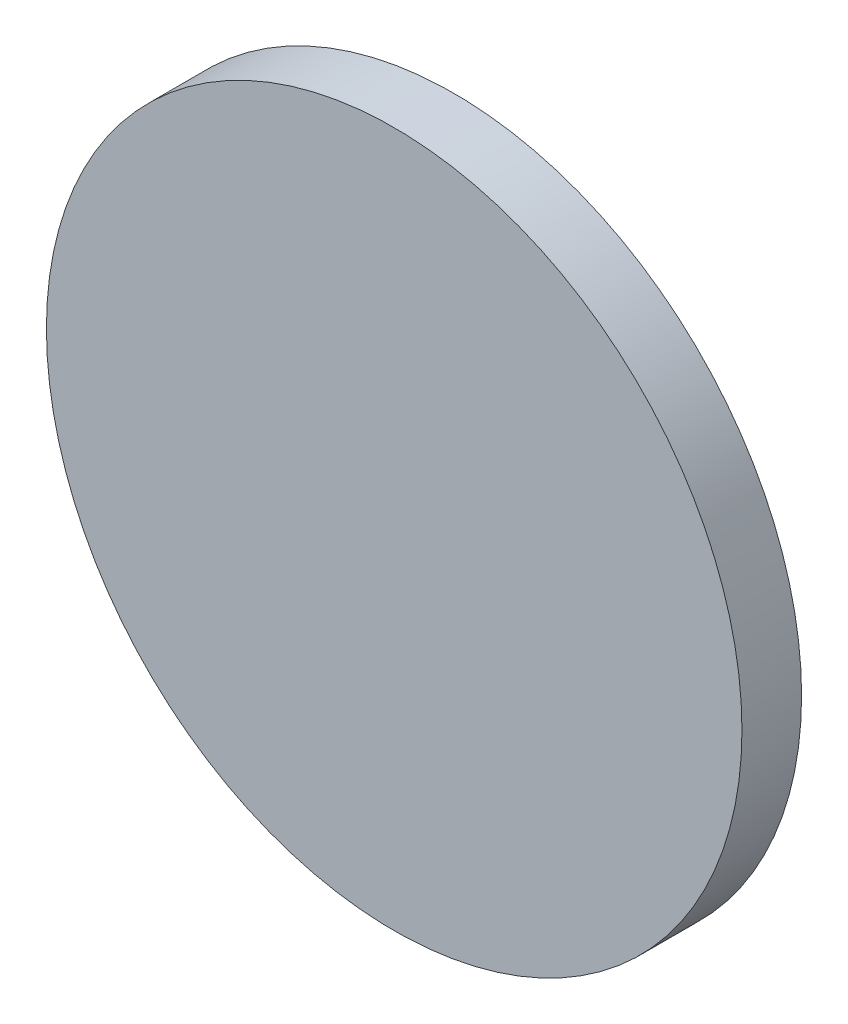
ISO-10303-21;
HEADER;
FILE_DESCRIPTION(('STEP AP214'),'2;1');
FILE_NAME('part.step','',(''),(''),'','','');
FILE_SCHEMA(('AUTOMOTIVE_DESIGN { 1 0 10303 214 1 1 1 1 }'));
ENDSEC;
DATA;
#1=APPLICATION_CONTEXT('core data for automotive mechanical design processes');
#2=APPLICATION_PROTOCOL_DEFINITION('international standard','automotive_design',2000,#1);
#3=PRODUCT_CONTEXT('',#1,'mechanical');
#4=PRODUCT('Part','Part','',(#3));
#5=PRODUCT_RELATED_PRODUCT_CATEGORY('part','',(#4));
#6=PRODUCT_DEFINITION_FORMATION('','',#4);
#7=PRODUCT_DEFINITION_CONTEXT('part definition',#1,'design');
#8=PRODUCT_DEFINITION('design','',#6,#7);
#9=PRODUCT_DEFINITION_SHAPE('','',#8);
#10=(LENGTH_UNIT() NAMED_UNIT(*) SI_UNIT(.MILLI.,.METRE.));
#11=(NAMED_UNIT(*) PLANE_ANGLE_UNIT() SI_UNIT($,.RADIAN.));
#12=(NAMED_UNIT(*) SI_UNIT($,.STERADIAN.) SOLID_ANGLE_UNIT());
#13=UNCERTAINTY_MEASURE_WITH_UNIT(LENGTH_MEASURE(1.E-05),#10,'distance_accuracy_value','');
#14=(GEOMETRIC_REPRESENTATION_CONTEXT(3) GLOBAL_UNCERTAINTY_ASSIGNED_CONTEXT((#13)) GLOBAL_UNIT_ASSIGNED_CONTEXT((#10,
#11,#12)) REPRESENTATION_CONTEXT('',''));
#15=CARTESIAN_POINT('',(0.,0.,0.));
#16=DIRECTION('',(0.,0.,1.));
#17=DIRECTION('',(1.,0.,0.));
#18=AXIS2_PLACEMENT_3D('',#15,#16,#17);
#19=CARTESIAN_POINT('',(4.6101,9.7663,0.76487));
#20=DIRECTION('',(0.,0.,-1.));
#21=DIRECTION('',(-1.,0.,0.));
#22=AXIS2_PLACEMENT_3D('',#19,#20,#21);
#23=PLANE('',#22);
#24=CARTESIAN_POINT('',(4.6101,9.7663,0.76487));
#25=DIRECTION('',(0.,0.,1.));
#26=DIRECTION('',(1.,0.,0.));
#27=AXIS2_PLACEMENT_3D('',#24,#25,#26);
#28=CIRCLE('',#27,0.200024667);
#29=CARTESIAN_POINT('',(4.810124667,9.7663,0.76487));
#30=VERTEX_POINT('',#29);
#31=EDGE_CURVE('E18',#30,#30,#28,.T.);
#32=ORIENTED_EDGE('',*,*,#31,.F.);
#33=EDGE_LOOP('',(#32));
#34=FACE_BOUND('',#33,.T.);
#35=ADVANCED_FACE('F15',(#34),#23,.T.);
#36=CARTESIAN_POINT('',(4.6101,9.7663,0.76487));
#37=DIRECTION('',(0.,0.,1.));
#38=DIRECTION('',(1.,0.,0.));
#39=AXIS2_PLACEMENT_3D('',#36,#37,#38);
#40=CYLINDRICAL_SURFACE('',#39,0.200024667);
#41=CARTESIAN_POINT('',(4.6101,9.7663,0.79916));
#42=DIRECTION('',(0.,0.,1.));
#43=DIRECTION('',(1.,0.,0.));
#44=AXIS2_PLACEMENT_3D('',#41,#42,#43);
#45=CIRCLE('',#44,0.200024667);
#46=CARTESIAN_POINT('',(4.810124667,9.7663,0.79916));
#47=VERTEX_POINT('',#46);
#48=EDGE_CURVE('E10',#47,#47,#45,.T.);
#49=ORIENTED_EDGE('',*,*,#48,.F.);
#50=EDGE_LOOP('',(#49));
#51=FACE_BOUND('',#50,.T.);
#52=ORIENTED_EDGE('',*,*,#31,.T.);
#53=EDGE_LOOP('',(#52));
#54=FACE_BOUND('',#53,.T.);
#55=ADVANCED_FACE('F27',(#51,#54),#40,.T.);
#56=CARTESIAN_POINT('',(4.6101,9.7663,0.79916));
#57=DIRECTION('',(0.,0.,1.));
#58=DIRECTION('',(1.,0.,0.));
#59=AXIS2_PLACEMENT_3D('',#56,#57,#58);
#60=PLANE('',#59);
#61=ORIENTED_EDGE('',*,*,#48,.T.);
#62=EDGE_LOOP('',(#61));
#63=FACE_BOUND('',#62,.T.);
#64=ADVANCED_FACE('F34',(#63),#60,.T.);
#65=CLOSED_SHELL('',(#35,#55,#64));
#66=MANIFOLD_SOLID_BREP('B1',#65);
#67=ADVANCED_BREP_SHAPE_REPRESENTATION('',(#18,#66),#14);
#68=SHAPE_DEFINITION_REPRESENTATION(#9,#67);
ENDSEC;
END-ISO-10303-21;
